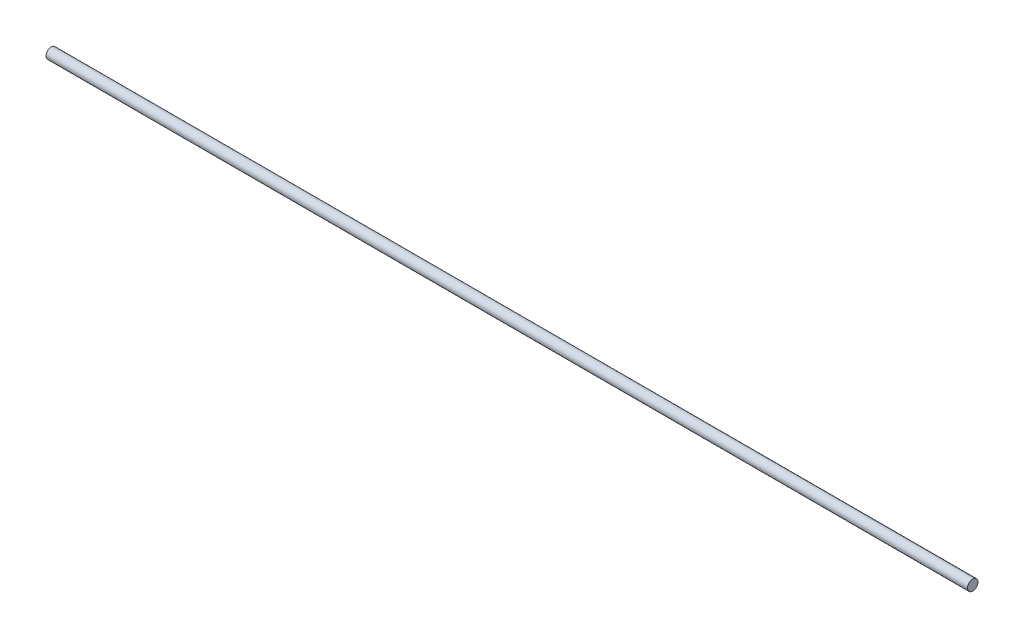
ISO-10303-21;
HEADER;
FILE_DESCRIPTION(('STEP AP214'),'2;1');
FILE_NAME('part.step','',(''),(''),'','','');
FILE_SCHEMA(('AUTOMOTIVE_DESIGN { 1 0 10303 214 1 1 1 1 }'));
ENDSEC;
DATA;
#1=APPLICATION_CONTEXT('core data for automotive mechanical design processes');
#2=APPLICATION_PROTOCOL_DEFINITION('international standard','automotive_design',2000,#1);
#3=PRODUCT_CONTEXT('',#1,'mechanical');
#4=PRODUCT('Part','Part','',(#3));
#5=PRODUCT_RELATED_PRODUCT_CATEGORY('part','',(#4));
#6=PRODUCT_DEFINITION_FORMATION('','',#4);
#7=PRODUCT_DEFINITION_CONTEXT('part definition',#1,'design');
#8=PRODUCT_DEFINITION('design','',#6,#7);
#9=PRODUCT_DEFINITION_SHAPE('','',#8);
#10=(LENGTH_UNIT() NAMED_UNIT(*) SI_UNIT(.MILLI.,.METRE.));
#11=(NAMED_UNIT(*) PLANE_ANGLE_UNIT() SI_UNIT($,.RADIAN.));
#12=(NAMED_UNIT(*) SI_UNIT($,.STERADIAN.) SOLID_ANGLE_UNIT());
#13=UNCERTAINTY_MEASURE_WITH_UNIT(LENGTH_MEASURE(1.E-05),#10,'distance_accuracy_value','');
#14=(GEOMETRIC_REPRESENTATION_CONTEXT(3) GLOBAL_UNCERTAINTY_ASSIGNED_CONTEXT((#13)) GLOBAL_UNIT_ASSIGNED_CONTEXT((#10,
#11,#12)) REPRESENTATION_CONTEXT('',''));
#15=CARTESIAN_POINT('',(0.,0.,0.));
#16=DIRECTION('',(0.,0.,1.));
#17=DIRECTION('',(1.,0.,0.));
#18=AXIS2_PLACEMENT_3D('',#15,#16,#17);
#19=CARTESIAN_POINT('',(0.,0.,0.));
#20=DIRECTION('',(1.,0.,0.));
#21=DIRECTION('',(0.,0.,-1.));
#22=AXIS2_PLACEMENT_3D('',#19,#20,#21);
#23=PLANE('',#22);
#24=CARTESIAN_POINT('',(0.,0.,0.));
#25=DIRECTION('',(1.,0.,0.));
#26=DIRECTION('',(0.,0.,-1.));
#27=AXIS2_PLACEMENT_3D('',#24,#25,#26);
#28=CIRCLE('',#27,3.125);
#29=CARTESIAN_POINT('',(0.,0.,-3.125));
#30=VERTEX_POINT('',#29);
#31=EDGE_CURVE('E56',#30,#30,#28,.T.);
#32=ORIENTED_EDGE('',*,*,#31,.F.);
#33=EDGE_LOOP('',(#32));
#34=FACE_BOUND('',#33,.T.);
#35=ADVANCED_FACE('F49',(#34),#23,.F.);
#36=CARTESIAN_POINT('',(550.,0.,0.));
#37=DIRECTION('',(1.,0.,0.));
#38=DIRECTION('',(0.,0.,-1.));
#39=AXIS2_PLACEMENT_3D('',#36,#37,#38);
#40=PLANE('',#39);
#41=CARTESIAN_POINT('',(550.,0.,0.));
#42=DIRECTION('',(1.,0.,0.));
#43=DIRECTION('',(0.,0.,-1.));
#44=AXIS2_PLACEMENT_3D('',#41,#42,#43);
#45=CIRCLE('',#44,3.125);
#46=CARTESIAN_POINT('',(550.,0.,-3.125));
#47=VERTEX_POINT('',#46);
#48=EDGE_CURVE('E11',#47,#47,#45,.T.);
#49=ORIENTED_EDGE('',*,*,#48,.T.);
#50=EDGE_LOOP('',(#49));
#51=FACE_BOUND('',#50,.T.);
#52=ADVANCED_FACE('F66',(#51),#40,.T.);
#53=CARTESIAN_POINT('',(0.,0.,0.));
#54=DIRECTION('',(1.,0.,0.));
#55=DIRECTION('',(0.,0.,-1.));
#56=AXIS2_PLACEMENT_3D('',#53,#54,#55);
#57=CYLINDRICAL_SURFACE('',#56,3.125);
#58=ORIENTED_EDGE('',*,*,#48,.F.);
#59=EDGE_LOOP('',(#58));
#60=FACE_BOUND('',#59,.T.);
#61=ORIENTED_EDGE('',*,*,#31,.T.);
#62=EDGE_LOOP('',(#61));
#63=FACE_BOUND('',#62,.T.);
#64=ADVANCED_FACE('F63',(#60,#63),#57,.T.);
#65=CLOSED_SHELL('',(#35,#52,#64));
#66=MANIFOLD_SOLID_BREP('B2',#65);
#67=ADVANCED_BREP_SHAPE_REPRESENTATION('',(#18,#66),#14);
#68=SHAPE_DEFINITION_REPRESENTATION(#9,#67);
ENDSEC;
END-ISO-10303-21;
